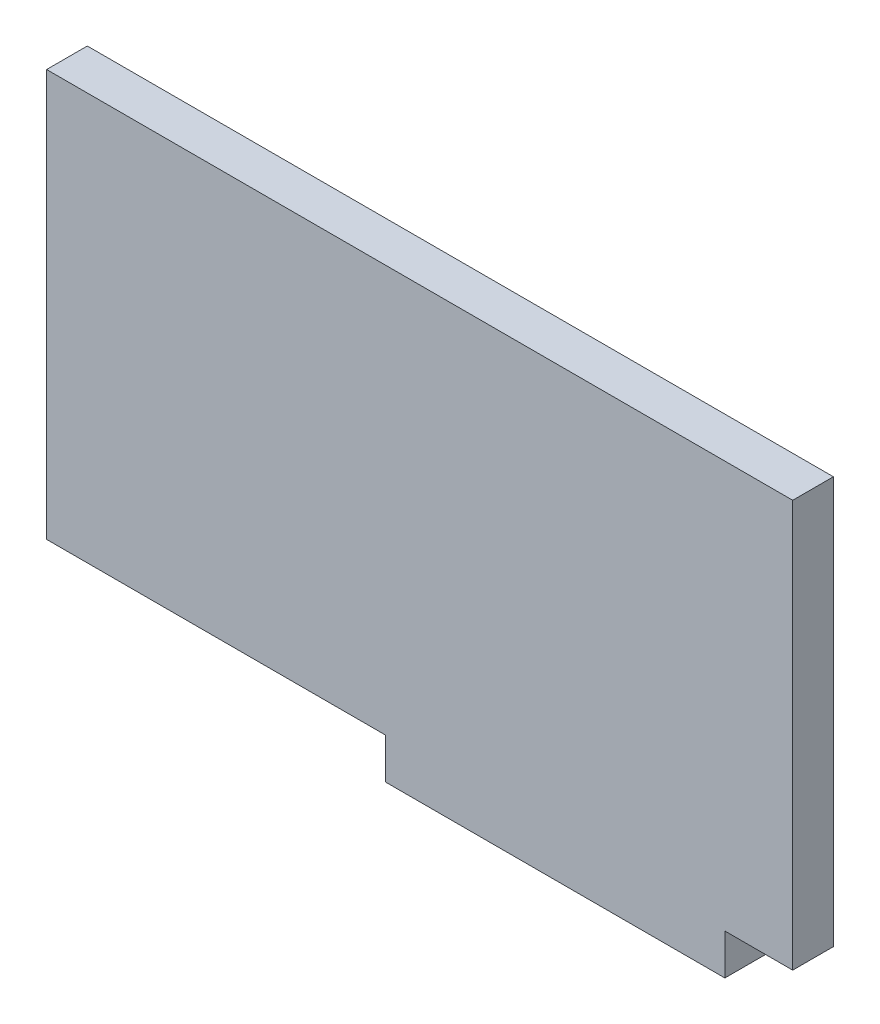
ISO-10303-21;
HEADER;
FILE_DESCRIPTION(('STEP AP214'),'2;1');
FILE_NAME('part.step','',(''),(''),'','','');
FILE_SCHEMA(('AUTOMOTIVE_DESIGN { 1 0 10303 214 1 1 1 1 }'));
ENDSEC;
DATA;
#1=APPLICATION_CONTEXT('core data for automotive mechanical design processes');
#2=APPLICATION_PROTOCOL_DEFINITION('international standard','automotive_design',2000,#1);
#3=PRODUCT_CONTEXT('',#1,'mechanical');
#4=PRODUCT('Part','Part','',(#3));
#5=PRODUCT_RELATED_PRODUCT_CATEGORY('part','',(#4));
#6=PRODUCT_DEFINITION_FORMATION('','',#4);
#7=PRODUCT_DEFINITION_CONTEXT('part definition',#1,'design');
#8=PRODUCT_DEFINITION('design','',#6,#7);
#9=PRODUCT_DEFINITION_SHAPE('','',#8);
#10=(LENGTH_UNIT() NAMED_UNIT(*) SI_UNIT(.MILLI.,.METRE.));
#11=(NAMED_UNIT(*) PLANE_ANGLE_UNIT() SI_UNIT($,.RADIAN.));
#12=(NAMED_UNIT(*) SI_UNIT($,.STERADIAN.) SOLID_ANGLE_UNIT());
#13=UNCERTAINTY_MEASURE_WITH_UNIT(LENGTH_MEASURE(1.E-05),#10,'distance_accuracy_value','');
#14=(GEOMETRIC_REPRESENTATION_CONTEXT(3) GLOBAL_UNCERTAINTY_ASSIGNED_CONTEXT((#13)) GLOBAL_UNIT_ASSIGNED_CONTEXT((#10,
#11,#12)) REPRESENTATION_CONTEXT('',''));
#15=CARTESIAN_POINT('',(0.,0.,0.));
#16=DIRECTION('',(0.,0.,1.));
#17=DIRECTION('',(1.,0.,0.));
#18=AXIS2_PLACEMENT_3D('',#15,#16,#17);
#19=CARTESIAN_POINT('',(-57.9411801297946,31.3697568172176,3.));
#20=DIRECTION('',(1.,0.,0.));
#21=DIRECTION('',(0.,1.,0.));
#22=AXIS2_PLACEMENT_3D('',#19,#20,#21);
#23=PLANE('',#22);
#24=DIRECTION('',(0.,-1.,0.));
#25=VECTOR('',#24,1.);
#26=CARTESIAN_POINT('',(-57.9411801297946,31.3697568172176,0.));
#27=LINE('',#26,#25);
#28=CARTESIAN_POINT('',(-57.9411801297946,31.3697568172176,0.));
#29=VERTEX_POINT('',#28);
#30=CARTESIAN_POINT('',(-57.9411801297946,1.36975681721755,0.));
#31=VERTEX_POINT('',#30);
#32=EDGE_CURVE('E129',#29,#31,#27,.T.);
#33=ORIENTED_EDGE('',*,*,#32,.T.);
#34=DIRECTION('',(0.,0.,-1.));
#35=VECTOR('',#34,1.);
#36=CARTESIAN_POINT('',(-57.9411801297946,1.36975681721755,3.));
#37=LINE('',#36,#35);
#38=CARTESIAN_POINT('',(-57.9411801297946,1.36975681721755,3.));
#39=VERTEX_POINT('',#38);
#40=EDGE_CURVE('E11',#39,#31,#37,.T.);
#41=ORIENTED_EDGE('',*,*,#40,.F.);
#42=DIRECTION('',(0.,-1.,0.));
#43=VECTOR('',#42,1.);
#44=CARTESIAN_POINT('',(-57.9411801297946,31.3697568172176,3.));
#45=LINE('',#44,#43);
#46=CARTESIAN_POINT('',(-57.9411801297946,31.3697568172176,3.));
#47=VERTEX_POINT('',#46);
#48=EDGE_CURVE('E143',#47,#39,#45,.T.);
#49=ORIENTED_EDGE('',*,*,#48,.F.);
#50=DIRECTION('',(0.,0.,-1.));
#51=VECTOR('',#50,1.);
#52=CARTESIAN_POINT('',(-57.9411801297946,31.3697568172176,3.));
#53=LINE('',#52,#51);
#54=EDGE_CURVE('E125',#47,#29,#53,.T.);
#55=ORIENTED_EDGE('',*,*,#54,.T.);
#56=EDGE_LOOP('',(#33,#41,#49,#55));
#57=FACE_BOUND('',#56,.T.);
#58=ADVANCED_FACE('F33',(#57),#23,.F.);
#59=CARTESIAN_POINT('',(-57.9411801297946,1.36975681721755,3.));
#60=DIRECTION('',(0.,1.,0.));
#61=DIRECTION('',(0.,0.,1.));
#62=AXIS2_PLACEMENT_3D('',#59,#60,#61);
#63=PLANE('',#62);
#64=DIRECTION('',(1.,0.,0.));
#65=VECTOR('',#64,1.);
#66=CARTESIAN_POINT('',(-57.9411801297946,1.36975681721755,0.));
#67=LINE('',#66,#65);
#68=CARTESIAN_POINT('',(-32.9411801297946,1.36975681721755,0.));
#69=VERTEX_POINT('',#68);
#70=EDGE_CURVE('E132',#31,#69,#67,.T.);
#71=ORIENTED_EDGE('',*,*,#70,.T.);
#72=DIRECTION('',(0.,0.,-1.));
#73=VECTOR('',#72,1.);
#74=CARTESIAN_POINT('',(-32.9411801297946,1.36975681721755,3.));
#75=LINE('',#74,#73);
#76=CARTESIAN_POINT('',(-32.9411801297946,1.36975681721755,3.));
#77=VERTEX_POINT('',#76);
#78=EDGE_CURVE('E41',#77,#69,#75,.T.);
#79=ORIENTED_EDGE('',*,*,#78,.F.);
#80=DIRECTION('',(1.,0.,0.));
#81=VECTOR('',#80,1.);
#82=CARTESIAN_POINT('',(-57.9411801297946,1.36975681721755,3.));
#83=LINE('',#82,#81);
#84=EDGE_CURVE('E92',#39,#77,#83,.T.);
#85=ORIENTED_EDGE('',*,*,#84,.F.);
#86=ORIENTED_EDGE('',*,*,#40,.T.);
#87=EDGE_LOOP('',(#71,#79,#85,#86));
#88=FACE_BOUND('',#87,.T.);
#89=ADVANCED_FACE('F178',(#88),#63,.F.);
#90=CARTESIAN_POINT('',(-32.9411801297946,1.36975681721755,3.));
#91=DIRECTION('',(1.,0.,0.));
#92=DIRECTION('',(0.,0.,-1.));
#93=AXIS2_PLACEMENT_3D('',#90,#91,#92);
#94=PLANE('',#93);
#95=DIRECTION('',(0.,-1.,0.));
#96=VECTOR('',#95,1.);
#97=CARTESIAN_POINT('',(-32.9411801297946,1.36975681721755,0.));
#98=LINE('',#97,#96);
#99=CARTESIAN_POINT('',(-32.9411801297946,-1.63024318278245,0.));
#100=VERTEX_POINT('',#99);
#101=EDGE_CURVE('E134',#69,#100,#98,.T.);
#102=ORIENTED_EDGE('',*,*,#101,.T.);
#103=DIRECTION('',(0.,0.,-1.));
#104=VECTOR('',#103,1.);
#105=CARTESIAN_POINT('',(-32.9411801297946,-1.63024318278245,3.));
#106=LINE('',#105,#104);
#107=CARTESIAN_POINT('',(-32.9411801297946,-1.63024318278245,3.));
#108=VERTEX_POINT('',#107);
#109=EDGE_CURVE('E150',#108,#100,#106,.T.);
#110=ORIENTED_EDGE('',*,*,#109,.F.);
#111=DIRECTION('',(0.,-1.,0.));
#112=VECTOR('',#111,1.);
#113=CARTESIAN_POINT('',(-32.9411801297946,1.36975681721755,3.));
#114=LINE('',#113,#112);
#115=EDGE_CURVE('E158',#77,#108,#114,.T.);
#116=ORIENTED_EDGE('',*,*,#115,.F.);
#117=ORIENTED_EDGE('',*,*,#78,.T.);
#118=EDGE_LOOP('',(#102,#110,#116,#117));
#119=FACE_BOUND('',#118,.T.);
#120=ADVANCED_FACE('F156',(#119),#94,.F.);
#121=CARTESIAN_POINT('',(-32.9411801297946,-1.63024318278245,3.));
#122=DIRECTION('',(0.,1.,0.));
#123=DIRECTION('',(0.,0.,1.));
#124=AXIS2_PLACEMENT_3D('',#121,#122,#123);
#125=PLANE('',#124);
#126=DIRECTION('',(1.,0.,0.));
#127=VECTOR('',#126,1.);
#128=CARTESIAN_POINT('',(-32.9411801297946,-1.63024318278245,0.));
#129=LINE('',#128,#127);
#130=CARTESIAN_POINT('',(-7.94118012979461,-1.63024318278245,0.));
#131=VERTEX_POINT('',#130);
#132=EDGE_CURVE('E136',#100,#131,#129,.T.);
#133=ORIENTED_EDGE('',*,*,#132,.T.);
#134=DIRECTION('',(0.,0.,-1.));
#135=VECTOR('',#134,1.);
#136=CARTESIAN_POINT('',(-7.94118012979461,-1.63024318278245,3.));
#137=LINE('',#136,#135);
#138=CARTESIAN_POINT('',(-7.94118012979461,-1.63024318278245,3.));
#139=VERTEX_POINT('',#138);
#140=EDGE_CURVE('E147',#139,#131,#137,.T.);
#141=ORIENTED_EDGE('',*,*,#140,.F.);
#142=DIRECTION('',(1.,0.,0.));
#143=VECTOR('',#142,1.);
#144=CARTESIAN_POINT('',(-32.9411801297946,-1.63024318278245,3.));
#145=LINE('',#144,#143);
#146=EDGE_CURVE('E170',#108,#139,#145,.T.);
#147=ORIENTED_EDGE('',*,*,#146,.F.);
#148=ORIENTED_EDGE('',*,*,#109,.T.);
#149=EDGE_LOOP('',(#133,#141,#147,#148));
#150=FACE_BOUND('',#149,.T.);
#151=ADVANCED_FACE('F166',(#150),#125,.F.);
#152=CARTESIAN_POINT('',(-7.94118012979461,1.36975681721755,3.));
#153=DIRECTION('',(-1.,0.,0.));
#154=DIRECTION('',(0.,0.,1.));
#155=AXIS2_PLACEMENT_3D('',#152,#153,#154);
#156=PLANE('',#155);
#157=DIRECTION('',(0.,1.,0.));
#158=VECTOR('',#157,1.);
#159=CARTESIAN_POINT('',(-7.94118012979461,1.36975681721755,0.));
#160=LINE('',#159,#158);
#161=CARTESIAN_POINT('',(-7.94118012979461,1.36975681721755,0.));
#162=VERTEX_POINT('',#161);
#163=EDGE_CURVE('E138',#131,#162,#160,.T.);
#164=ORIENTED_EDGE('',*,*,#163,.T.);
#165=DIRECTION('',(0.,0.,-1.));
#166=VECTOR('',#165,1.);
#167=CARTESIAN_POINT('',(-7.94118012979461,1.36975681721755,3.));
#168=LINE('',#167,#166);
#169=CARTESIAN_POINT('',(-7.94118012979461,1.36975681721755,3.));
#170=VERTEX_POINT('',#169);
#171=EDGE_CURVE('E120',#170,#162,#168,.T.);
#172=ORIENTED_EDGE('',*,*,#171,.F.);
#173=DIRECTION('',(0.,1.,0.));
#174=VECTOR('',#173,1.);
#175=CARTESIAN_POINT('',(-7.94118012979461,1.36975681721755,3.));
#176=LINE('',#175,#174);
#177=EDGE_CURVE('E111',#139,#170,#176,.T.);
#178=ORIENTED_EDGE('',*,*,#177,.F.);
#179=ORIENTED_EDGE('',*,*,#140,.T.);
#180=EDGE_LOOP('',(#164,#172,#178,#179));
#181=FACE_BOUND('',#180,.T.);
#182=ADVANCED_FACE('F169',(#181),#156,.F.);
#183=CARTESIAN_POINT('',(-7.94118012979461,1.36975681721755,3.));
#184=DIRECTION('',(0.,1.,0.));
#185=DIRECTION('',(-1.,0.,0.));
#186=AXIS2_PLACEMENT_3D('',#183,#184,#185);
#187=PLANE('',#186);
#188=DIRECTION('',(1.,0.,0.));
#189=VECTOR('',#188,1.);
#190=CARTESIAN_POINT('',(-7.94118012979461,1.36975681721755,0.));
#191=LINE('',#190,#189);
#192=CARTESIAN_POINT('',(-2.94118012979462,1.36975681721755,0.));
#193=VERTEX_POINT('',#192);
#194=EDGE_CURVE('E119',#162,#193,#191,.T.);
#195=ORIENTED_EDGE('',*,*,#194,.T.);
#196=DIRECTION('',(0.,0.,-1.));
#197=VECTOR('',#196,1.);
#198=CARTESIAN_POINT('',(-2.94118012979462,1.36975681721755,3.));
#199=LINE('',#198,#197);
#200=CARTESIAN_POINT('',(-2.94118012979462,1.36975681721755,3.));
#201=VERTEX_POINT('',#200);
#202=EDGE_CURVE('E116',#201,#193,#199,.T.);
#203=ORIENTED_EDGE('',*,*,#202,.F.);
#204=DIRECTION('',(1.,0.,0.));
#205=VECTOR('',#204,1.);
#206=CARTESIAN_POINT('',(-7.94118012979461,1.36975681721755,3.));
#207=LINE('',#206,#205);
#208=EDGE_CURVE('E105',#170,#201,#207,.T.);
#209=ORIENTED_EDGE('',*,*,#208,.F.);
#210=ORIENTED_EDGE('',*,*,#171,.T.);
#211=EDGE_LOOP('',(#195,#203,#209,#210));
#212=FACE_BOUND('',#211,.T.);
#213=ADVANCED_FACE('F117',(#212),#187,.F.);
#214=CARTESIAN_POINT('',(-2.94118012979462,31.3697568172176,3.));
#215=DIRECTION('',(-1.,0.,0.));
#216=DIRECTION('',(0.,-1.,0.));
#217=AXIS2_PLACEMENT_3D('',#214,#215,#216);
#218=PLANE('',#217);
#219=DIRECTION('',(0.,1.,0.));
#220=VECTOR('',#219,1.);
#221=CARTESIAN_POINT('',(-2.94118012979462,31.3697568172176,0.));
#222=LINE('',#221,#220);
#223=CARTESIAN_POINT('',(-2.94118012979462,31.3697568172176,0.));
#224=VERTEX_POINT('',#223);
#225=EDGE_CURVE('E78',#193,#224,#222,.T.);
#226=ORIENTED_EDGE('',*,*,#225,.T.);
#227=DIRECTION('',(0.,0.,-1.));
#228=VECTOR('',#227,1.);
#229=CARTESIAN_POINT('',(-2.94118012979462,31.3697568172176,3.));
#230=LINE('',#229,#228);
#231=CARTESIAN_POINT('',(-2.94118012979462,31.3697568172176,3.));
#232=VERTEX_POINT('',#231);
#233=EDGE_CURVE('E121',#232,#224,#230,.T.);
#234=ORIENTED_EDGE('',*,*,#233,.F.);
#235=DIRECTION('',(0.,1.,0.));
#236=VECTOR('',#235,1.);
#237=CARTESIAN_POINT('',(-2.94118012979462,31.3697568172176,3.));
#238=LINE('',#237,#236);
#239=EDGE_CURVE('E109',#201,#232,#238,.T.);
#240=ORIENTED_EDGE('',*,*,#239,.F.);
#241=ORIENTED_EDGE('',*,*,#202,.T.);
#242=EDGE_LOOP('',(#226,#234,#240,#241));
#243=FACE_BOUND('',#242,.T.);
#244=ADVANCED_FACE('F123',(#243),#218,.F.);
#245=CARTESIAN_POINT('',(-57.9411801297946,31.3697568172176,3.));
#246=DIRECTION('',(0.,-1.,0.));
#247=DIRECTION('',(0.,0.,-1.));
#248=AXIS2_PLACEMENT_3D('',#245,#246,#247);
#249=PLANE('',#248);
#250=DIRECTION('',(-1.,0.,0.));
#251=VECTOR('',#250,1.);
#252=CARTESIAN_POINT('',(-57.9411801297946,31.3697568172176,0.));
#253=LINE('',#252,#251);
#254=EDGE_CURVE('E84',#224,#29,#253,.T.);
#255=ORIENTED_EDGE('',*,*,#254,.T.);
#256=ORIENTED_EDGE('',*,*,#54,.F.);
#257=DIRECTION('',(-1.,0.,0.));
#258=VECTOR('',#257,1.);
#259=CARTESIAN_POINT('',(-57.9411801297946,31.3697568172176,3.));
#260=LINE('',#259,#258);
#261=EDGE_CURVE('E49',#232,#47,#260,.T.);
#262=ORIENTED_EDGE('',*,*,#261,.F.);
#263=ORIENTED_EDGE('',*,*,#233,.T.);
#264=EDGE_LOOP('',(#255,#256,#262,#263));
#265=FACE_BOUND('',#264,.T.);
#266=ADVANCED_FACE('F194',(#265),#249,.F.);
#267=CARTESIAN_POINT('',(0.,0.,3.));
#268=DIRECTION('',(0.,0.,1.));
#269=DIRECTION('',(1.,0.,0.));
#270=AXIS2_PLACEMENT_3D('',#267,#268,#269);
#271=PLANE('',#270);
#272=ORIENTED_EDGE('',*,*,#48,.T.);
#273=ORIENTED_EDGE('',*,*,#84,.T.);
#274=ORIENTED_EDGE('',*,*,#115,.T.);
#275=ORIENTED_EDGE('',*,*,#146,.T.);
#276=ORIENTED_EDGE('',*,*,#177,.T.);
#277=ORIENTED_EDGE('',*,*,#208,.T.);
#278=ORIENTED_EDGE('',*,*,#239,.T.);
#279=ORIENTED_EDGE('',*,*,#261,.T.);
#280=EDGE_LOOP('',(#272,#273,#274,#275,#276,#277,#278,#279));
#281=FACE_BOUND('',#280,.T.);
#282=ADVANCED_FACE('F107',(#281),#271,.T.);
#283=CARTESIAN_POINT('',(0.,0.,0.));
#284=DIRECTION('',(0.,0.,1.));
#285=DIRECTION('',(1.,0.,0.));
#286=AXIS2_PLACEMENT_3D('',#283,#284,#285);
#287=PLANE('',#286);
#288=ORIENTED_EDGE('',*,*,#32,.F.);
#289=ORIENTED_EDGE('',*,*,#254,.F.);
#290=ORIENTED_EDGE('',*,*,#225,.F.);
#291=ORIENTED_EDGE('',*,*,#194,.F.);
#292=ORIENTED_EDGE('',*,*,#163,.F.);
#293=ORIENTED_EDGE('',*,*,#132,.F.);
#294=ORIENTED_EDGE('',*,*,#101,.F.);
#295=ORIENTED_EDGE('',*,*,#70,.F.);
#296=EDGE_LOOP('',(#288,#289,#290,#291,#292,#293,#294,#295));
#297=FACE_BOUND('',#296,.T.);
#298=ADVANCED_FACE('F162',(#297),#287,.F.);
#299=CLOSED_SHELL('',(#58,#89,#120,#151,#182,#213,#244,#266,#282,#298));
#300=MANIFOLD_SOLID_BREP('B2',#299);
#301=ADVANCED_BREP_SHAPE_REPRESENTATION('',(#18,#300),#14);
#302=SHAPE_DEFINITION_REPRESENTATION(#9,#301);
ENDSEC;
END-ISO-10303-21;
